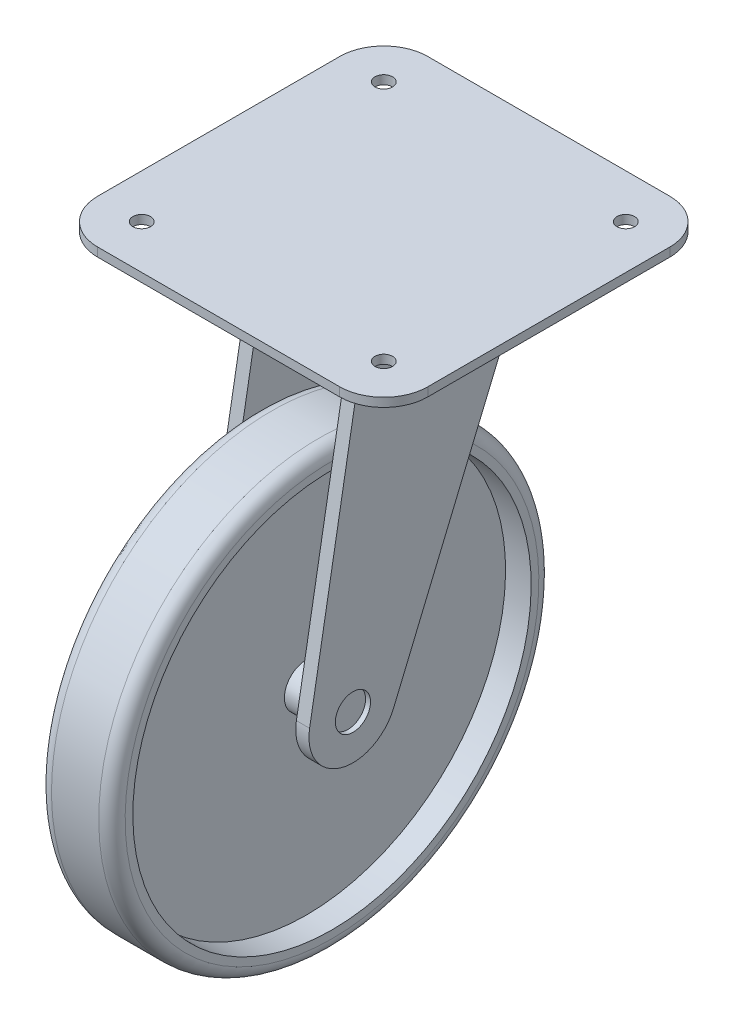
ISO-10303-21;
HEADER;
FILE_DESCRIPTION(('STEP AP214'),'2;1');
FILE_NAME('part.step','',(''),(''),'','','');
FILE_SCHEMA(('AUTOMOTIVE_DESIGN { 1 0 10303 214 1 1 1 1 }'));
ENDSEC;
DATA;
#1=APPLICATION_CONTEXT('core data for automotive mechanical design processes');
#2=APPLICATION_PROTOCOL_DEFINITION('international standard','automotive_design',2000,#1);
#3=PRODUCT_CONTEXT('',#1,'mechanical');
#4=PRODUCT('Part','Part','',(#3));
#5=PRODUCT_RELATED_PRODUCT_CATEGORY('part','',(#4));
#6=PRODUCT_DEFINITION_FORMATION('','',#4);
#7=PRODUCT_DEFINITION_CONTEXT('part definition',#1,'design');
#8=PRODUCT_DEFINITION('design','',#6,#7);
#9=PRODUCT_DEFINITION_SHAPE('','',#8);
#10=(LENGTH_UNIT() NAMED_UNIT(*) SI_UNIT(.MILLI.,.METRE.));
#11=(NAMED_UNIT(*) PLANE_ANGLE_UNIT() SI_UNIT($,.RADIAN.));
#12=(NAMED_UNIT(*) SI_UNIT($,.STERADIAN.) SOLID_ANGLE_UNIT());
#13=UNCERTAINTY_MEASURE_WITH_UNIT(LENGTH_MEASURE(1.E-05),#10,'distance_accuracy_value','');
#14=(GEOMETRIC_REPRESENTATION_CONTEXT(3) GLOBAL_UNCERTAINTY_ASSIGNED_CONTEXT((#13)) GLOBAL_UNIT_ASSIGNED_CONTEXT((#10,
#11,#12)) REPRESENTATION_CONTEXT('',''));
#15=CARTESIAN_POINT('',(0.,0.,0.));
#16=DIRECTION('',(0.,0.,1.));
#17=DIRECTION('',(1.,0.,0.));
#18=AXIS2_PLACEMENT_3D('',#15,#16,#17);
#19=CARTESIAN_POINT('',(11.8719218743825,-80.,20.));
#20=DIRECTION('',(-1.,0.,0.));
#21=DIRECTION('',(0.,-1.,0.));
#22=AXIS2_PLACEMENT_3D('',#19,#20,#21);
#23=PLANE('',#22);
#24=CARTESIAN_POINT('',(11.8719218743826,-80.,20.));
#25=DIRECTION('',(-1.,0.,0.));
#26=DIRECTION('',(0.,-1.,0.));
#27=AXIS2_PLACEMENT_3D('',#24,#25,#26);
#28=CIRCLE('',#27,5.);
#29=CARTESIAN_POINT('',(11.8719218743826,-85.,20.));
#30=VERTEX_POINT('',#29);
#31=EDGE_CURVE('E83',#30,#30,#28,.T.);
#32=ORIENTED_EDGE('',*,*,#31,.F.);
#33=EDGE_LOOP('',(#32));
#34=FACE_BOUND('',#33,.T.);
#35=ADVANCED_FACE('F43',(#34),#23,.F.);
#36=CARTESIAN_POINT('',(-12.1180558785947,-80.,20.));
#37=DIRECTION('',(1.,0.,0.));
#38=DIRECTION('',(0.,1.,0.));
#39=AXIS2_PLACEMENT_3D('',#36,#37,#38);
#40=PLANE('',#39);
#41=CARTESIAN_POINT('',(-12.1180558785947,-80.,20.));
#42=DIRECTION('',(-1.,0.,0.));
#43=DIRECTION('',(0.,-1.,0.));
#44=AXIS2_PLACEMENT_3D('',#41,#42,#43);
#45=CIRCLE('',#44,5.00000000000002);
#46=CARTESIAN_POINT('',(-12.1180558785947,-85.,20.));
#47=VERTEX_POINT('',#46);
#48=EDGE_CURVE('E11',#47,#47,#45,.T.);
#49=ORIENTED_EDGE('',*,*,#48,.T.);
#50=EDGE_LOOP('',(#49));
#51=FACE_BOUND('',#50,.T.);
#52=ADVANCED_FACE('F90',(#51),#40,.F.);
#53=CARTESIAN_POINT('',(-10.,-80.,20.));
#54=DIRECTION('',(-1.,0.,0.));
#55=DIRECTION('',(0.,-1.,0.));
#56=AXIS2_PLACEMENT_3D('',#53,#54,#55);
#57=CYLINDRICAL_SURFACE('',#56,5.00000000000002);
#58=ORIENTED_EDGE('',*,*,#48,.F.);
#59=EDGE_LOOP('',(#58));
#60=FACE_BOUND('',#59,.T.);
#61=CARTESIAN_POINT('',(-2.64928912323991,-80.,20.));
#62=DIRECTION('',(-1.,0.,0.));
#63=DIRECTION('',(0.,-1.,0.));
#64=AXIS2_PLACEMENT_3D('',#61,#62,#63);
#65=CIRCLE('',#64,5.00000000000001);
#66=CARTESIAN_POINT('',(-2.64928912323991,-85.,20.));
#67=VERTEX_POINT('',#66);
#68=EDGE_CURVE('E49',#67,#67,#65,.T.);
#69=ORIENTED_EDGE('',*,*,#68,.T.);
#70=EDGE_LOOP('',(#69));
#71=FACE_BOUND('',#70,.T.);
#72=ADVANCED_FACE('F94',(#60,#71),#57,.T.);
#73=CARTESIAN_POINT('',(-2.6492891232399,-75.,20.));
#74=DIRECTION('',(1.,0.,0.));
#75=DIRECTION('',(0.,1.,0.));
#76=AXIS2_PLACEMENT_3D('',#73,#74,#75);
#77=PLANE('',#76);
#78=ORIENTED_EDGE('',*,*,#68,.F.);
#79=EDGE_LOOP('',(#78));
#80=FACE_BOUND('',#79,.T.);
#81=CARTESIAN_POINT('',(-2.64928912323989,-80.,20.));
#82=DIRECTION('',(-1.,0.,0.));
#83=DIRECTION('',(0.,-1.,0.));
#84=AXIS2_PLACEMENT_3D('',#81,#82,#83);
#85=CIRCLE('',#84,45.251746634803);
#86=CARTESIAN_POINT('',(-2.64928912323986,-125.251746634803,20.));
#87=VERTEX_POINT('',#86);
#88=EDGE_CURVE('E53',#87,#87,#85,.T.);
#89=ORIENTED_EDGE('',*,*,#88,.T.);
#90=EDGE_LOOP('',(#89));
#91=FACE_BOUND('',#90,.T.);
#92=ADVANCED_FACE('F98',(#80,#91),#77,.F.);
#93=CARTESIAN_POINT('',(-10.,-80.,20.));
#94=DIRECTION('',(-1.,0.,0.));
#95=DIRECTION('',(0.,-1.,0.));
#96=AXIS2_PLACEMENT_3D('',#93,#94,#95);
#97=CYLINDRICAL_SURFACE('',#96,45.251746634803);
#98=ORIENTED_EDGE('',*,*,#88,.F.);
#99=EDGE_LOOP('',(#98));
#100=FACE_BOUND('',#99,.T.);
#101=CARTESIAN_POINT('',(-8.49771205244607,-80.,20.));
#102=DIRECTION('',(-1.,0.,0.));
#103=DIRECTION('',(0.,-1.,0.));
#104=AXIS2_PLACEMENT_3D('',#101,#102,#103);
#105=CIRCLE('',#104,45.251746634803);
#106=CARTESIAN_POINT('',(-8.49771205244604,-125.251746634803,20.));
#107=VERTEX_POINT('',#106);
#108=EDGE_CURVE('E57',#107,#107,#105,.T.);
#109=ORIENTED_EDGE('',*,*,#108,.T.);
#110=EDGE_LOOP('',(#109));
#111=FACE_BOUND('',#110,.T.);
#112=ADVANCED_FACE('F104',(#100,#111),#97,.F.);
#113=CARTESIAN_POINT('',(-8.49771205244609,-33.,20.));
#114=DIRECTION('',(1.,0.,0.));
#115=DIRECTION('',(0.,1.,0.));
#116=AXIS2_PLACEMENT_3D('',#113,#114,#115);
#117=PLANE('',#116);
#118=ORIENTED_EDGE('',*,*,#108,.F.);
#119=EDGE_LOOP('',(#118));
#120=FACE_BOUND('',#119,.T.);
#121=CARTESIAN_POINT('',(-8.49771205244606,-80.,20.));
#122=DIRECTION('',(-1.,0.,0.));
#123=DIRECTION('',(0.,-1.,0.));
#124=AXIS2_PLACEMENT_3D('',#121,#122,#123);
#125=CIRCLE('',#124,47.);
#126=CARTESIAN_POINT('',(-8.49771205244604,-127.,20.));
#127=VERTEX_POINT('',#126);
#128=EDGE_CURVE('E62',#127,#127,#125,.T.);
#129=ORIENTED_EDGE('',*,*,#128,.T.);
#130=EDGE_LOOP('',(#129));
#131=FACE_BOUND('',#130,.T.);
#132=ADVANCED_FACE('F108',(#120,#131),#117,.F.);
#133=CARTESIAN_POINT('',(-5.49771205244606,-80.,20.));
#134=DIRECTION('',(-1.,0.,0.));
#135=DIRECTION('',(0.,-1.,0.));
#136=AXIS2_PLACEMENT_3D('',#133,#134,#135);
#137=TOROIDAL_SURFACE('',#136,47.,3.);
#138=ORIENTED_EDGE('',*,*,#128,.F.);
#139=EDGE_LOOP('',(#138));
#140=FACE_BOUND('',#139,.T.);
#141=CARTESIAN_POINT('',(-5.49771205244606,-80.,20.));
#142=DIRECTION('',(-1.,0.,0.));
#143=DIRECTION('',(0.,-1.,0.));
#144=AXIS2_PLACEMENT_3D('',#141,#142,#143);
#145=CIRCLE('',#144,50.);
#146=CARTESIAN_POINT('',(-5.49771205244603,-130.,20.));
#147=VERTEX_POINT('',#146);
#148=EDGE_CURVE('E65',#147,#147,#145,.T.);
#149=ORIENTED_EDGE('',*,*,#148,.T.);
#150=EDGE_LOOP('',(#149));
#151=FACE_BOUND('',#150,.T.);
#152=ADVANCED_FACE('F112',(#140,#151),#137,.T.);
#153=CARTESIAN_POINT('',(-10.,-80.,20.));
#154=DIRECTION('',(-1.,0.,0.));
#155=DIRECTION('',(0.,-1.,0.));
#156=AXIS2_PLACEMENT_3D('',#153,#154,#155);
#157=CYLINDRICAL_SURFACE('',#156,50.);
#158=ORIENTED_EDGE('',*,*,#148,.F.);
#159=EDGE_LOOP('',(#158));
#160=FACE_BOUND('',#159,.T.);
#161=CARTESIAN_POINT('',(5.24062529719608,-80.,20.));
#162=DIRECTION('',(-1.,0.,0.));
#163=DIRECTION('',(0.,-1.,0.));
#164=AXIS2_PLACEMENT_3D('',#161,#162,#163);
#165=CIRCLE('',#164,50.);
#166=CARTESIAN_POINT('',(5.24062529719611,-130.,20.));
#167=VERTEX_POINT('',#166);
#168=EDGE_CURVE('E68',#167,#167,#165,.T.);
#169=ORIENTED_EDGE('',*,*,#168,.T.);
#170=EDGE_LOOP('',(#169));
#171=FACE_BOUND('',#170,.T.);
#172=ADVANCED_FACE('F116',(#160,#171),#157,.T.);
#173=CARTESIAN_POINT('',(5.24062529719608,-80.,20.));
#174=DIRECTION('',(-1.,0.,0.));
#175=DIRECTION('',(0.,-1.,0.));
#176=AXIS2_PLACEMENT_3D('',#173,#174,#175);
#177=TOROIDAL_SURFACE('',#176,47.,3.);
#178=ORIENTED_EDGE('',*,*,#168,.F.);
#179=EDGE_LOOP('',(#178));
#180=FACE_BOUND('',#179,.T.);
#181=CARTESIAN_POINT('',(8.24062529719608,-80.,20.));
#182=DIRECTION('',(-1.,0.,0.));
#183=DIRECTION('',(0.,-1.,0.));
#184=AXIS2_PLACEMENT_3D('',#181,#182,#183);
#185=CIRCLE('',#184,47.);
#186=CARTESIAN_POINT('',(8.24062529719611,-127.,20.));
#187=VERTEX_POINT('',#186);
#188=EDGE_CURVE('E71',#187,#187,#185,.T.);
#189=ORIENTED_EDGE('',*,*,#188,.T.);
#190=EDGE_LOOP('',(#189));
#191=FACE_BOUND('',#190,.T.);
#192=ADVANCED_FACE('F120',(#180,#191),#177,.T.);
#193=CARTESIAN_POINT('',(8.24062529719605,-33.,20.));
#194=DIRECTION('',(-1.,0.,0.));
#195=DIRECTION('',(0.,-1.,0.));
#196=AXIS2_PLACEMENT_3D('',#193,#194,#195);
#197=PLANE('',#196);
#198=ORIENTED_EDGE('',*,*,#188,.F.);
#199=EDGE_LOOP('',(#198));
#200=FACE_BOUND('',#199,.T.);
#201=CARTESIAN_POINT('',(8.24062529719608,-80.,20.));
#202=DIRECTION('',(-1.,0.,0.));
#203=DIRECTION('',(0.,-1.,0.));
#204=AXIS2_PLACEMENT_3D('',#201,#202,#203);
#205=CIRCLE('',#204,45.251746634803);
#206=CARTESIAN_POINT('',(8.24062529719611,-125.251746634803,20.));
#207=VERTEX_POINT('',#206);
#208=EDGE_CURVE('E74',#207,#207,#205,.T.);
#209=ORIENTED_EDGE('',*,*,#208,.T.);
#210=EDGE_LOOP('',(#209));
#211=FACE_BOUND('',#210,.T.);
#212=ADVANCED_FACE('F124',(#200,#211),#197,.F.);
#213=CARTESIAN_POINT('',(-10.,-80.,20.));
#214=DIRECTION('',(-1.,0.,0.));
#215=DIRECTION('',(0.,-1.,0.));
#216=AXIS2_PLACEMENT_3D('',#213,#214,#215);
#217=CYLINDRICAL_SURFACE('',#216,45.251746634803);
#218=ORIENTED_EDGE('',*,*,#208,.F.);
#219=EDGE_LOOP('',(#218));
#220=FACE_BOUND('',#219,.T.);
#221=CARTESIAN_POINT('',(2.42722895289974,-80.,20.));
#222=DIRECTION('',(-1.,0.,0.));
#223=DIRECTION('',(0.,-1.,0.));
#224=AXIS2_PLACEMENT_3D('',#221,#222,#223);
#225=CIRCLE('',#224,45.251746634803);
#226=CARTESIAN_POINT('',(2.42722895289977,-125.251746634803,20.));
#227=VERTEX_POINT('',#226);
#228=EDGE_CURVE('E77',#227,#227,#225,.T.);
#229=ORIENTED_EDGE('',*,*,#228,.T.);
#230=EDGE_LOOP('',(#229));
#231=FACE_BOUND('',#230,.T.);
#232=ADVANCED_FACE('F128',(#220,#231),#217,.F.);
#233=CARTESIAN_POINT('',(2.42722895289972,-75.,20.));
#234=DIRECTION('',(-1.,0.,0.));
#235=DIRECTION('',(0.,-1.,0.));
#236=AXIS2_PLACEMENT_3D('',#233,#234,#235);
#237=PLANE('',#236);
#238=ORIENTED_EDGE('',*,*,#228,.F.);
#239=EDGE_LOOP('',(#238));
#240=FACE_BOUND('',#239,.T.);
#241=CARTESIAN_POINT('',(2.42722895289971,-80.,20.));
#242=DIRECTION('',(-1.,0.,0.));
#243=DIRECTION('',(0.,-1.,0.));
#244=AXIS2_PLACEMENT_3D('',#241,#242,#243);
#245=CIRCLE('',#244,5.00000000000001);
#246=CARTESIAN_POINT('',(2.42722895289971,-85.,20.));
#247=VERTEX_POINT('',#246);
#248=EDGE_CURVE('E80',#247,#247,#245,.T.);
#249=ORIENTED_EDGE('',*,*,#248,.T.);
#250=EDGE_LOOP('',(#249));
#251=FACE_BOUND('',#250,.T.);
#252=ADVANCED_FACE('F132',(#240,#251),#237,.F.);
#253=CARTESIAN_POINT('',(-10.,-80.,20.));
#254=DIRECTION('',(-1.,0.,0.));
#255=DIRECTION('',(0.,-1.,0.));
#256=AXIS2_PLACEMENT_3D('',#253,#254,#255);
#257=CYLINDRICAL_SURFACE('',#256,5.);
#258=ORIENTED_EDGE('',*,*,#248,.F.);
#259=EDGE_LOOP('',(#258));
#260=FACE_BOUND('',#259,.T.);
#261=ORIENTED_EDGE('',*,*,#31,.T.);
#262=EDGE_LOOP('',(#261));
#263=FACE_BOUND('',#262,.T.);
#264=ADVANCED_FACE('F87',(#260,#263),#257,.T.);
#265=CLOSED_SHELL('',(#35,#52,#72,#92,#112,#132,#152,#172,#192,#212,#232,#252,#264));
#266=MANIFOLD_SOLID_BREP('B2',#265);
#267=CARTESIAN_POINT('',(0.,-8.,0.));
#268=DIRECTION('',(0.,-1.,0.));
#269=DIRECTION('',(0.,0.,-1.));
#270=AXIS2_PLACEMENT_3D('',#267,#268,#269);
#271=PLANE('',#270);
#272=DIRECTION('',(1.,0.,0.));
#273=VECTOR('',#272,1.);
#274=CARTESIAN_POINT('',(-13.,-8.,17.549509852951));
#275=LINE('',#274,#273);
#276=CARTESIAN_POINT('',(-13.,-8.,17.549509852951));
#277=VERTEX_POINT('',#276);
#278=CARTESIAN_POINT('',(-11.9970217222776,-8.,17.549509852951));
#279=VERTEX_POINT('',#278);
#280=EDGE_CURVE('E377',#277,#279,#275,.T.);
#281=ORIENTED_EDGE('',*,*,#280,.T.);
#282=CARTESIAN_POINT('',(0.,-8.,0.));
#283=DIRECTION('',(0.,-1.,0.));
#284=DIRECTION('',(0.,0.,-1.));
#285=AXIS2_PLACEMENT_3D('',#282,#283,#284);
#286=CIRCLE('',#285,21.2582648935331);
#287=CARTESIAN_POINT('',(11.9970217222776,-8.,17.549509852951));
#288=VERTEX_POINT('',#287);
#289=EDGE_CURVE('E843',#288,#279,#286,.T.);
#290=ORIENTED_EDGE('',*,*,#289,.F.);
#291=DIRECTION('',(-1.,0.,0.));
#292=VECTOR('',#291,1.);
#293=CARTESIAN_POINT('',(13.,-8.,17.549509852951));
#294=LINE('',#293,#292);
#295=CARTESIAN_POINT('',(13.,-8.,17.549509852951));
#296=VERTEX_POINT('',#295);
#297=EDGE_CURVE('E454',#296,#288,#294,.T.);
#298=ORIENTED_EDGE('',*,*,#297,.F.);
#299=DIRECTION('',(0.,0.,1.));
#300=VECTOR('',#299,1.);
#301=CARTESIAN_POINT('',(13.,-8.,17.549509852951));
#302=LINE('',#301,#300);
#303=CARTESIAN_POINT('',(13.,-8.,16.8200423983896));
#304=VERTEX_POINT('',#303);
#305=EDGE_CURVE('E41',#304,#296,#302,.T.);
#306=ORIENTED_EDGE('',*,*,#305,.F.);
#307=CARTESIAN_POINT('',(13.,-8.,-16.8200423983896));
#308=VERTEX_POINT('',#307);
#309=EDGE_CURVE('E471',#308,#304,#286,.T.);
#310=ORIENTED_EDGE('',*,*,#309,.F.);
#311=CARTESIAN_POINT('',(13.,-8.,-20.963551469519));
#312=VERTEX_POINT('',#311);
#313=EDGE_CURVE('E244',#312,#308,#302,.T.);
#314=ORIENTED_EDGE('',*,*,#313,.F.);
#315=DIRECTION('',(-1.,0.,0.));
#316=VECTOR('',#315,1.);
#317=CARTESIAN_POINT('',(13.,-8.,-20.963551469519));
#318=LINE('',#317,#316);
#319=CARTESIAN_POINT('',(10.,-8.,-20.963551469519));
#320=VERTEX_POINT('',#319);
#321=EDGE_CURVE('E457',#312,#320,#318,.T.);
#322=ORIENTED_EDGE('',*,*,#321,.T.);
#323=DIRECTION('',(0.,0.,1.));
#324=VECTOR('',#323,1.);
#325=CARTESIAN_POINT('',(10.,-8.,17.549509852951));
#326=LINE('',#325,#324);
#327=CARTESIAN_POINT('',(10.,-8.,-18.7593663614639));
#328=VERTEX_POINT('',#327);
#329=EDGE_CURVE('E438',#320,#328,#326,.T.);
#330=ORIENTED_EDGE('',*,*,#329,.T.);
#331=CARTESIAN_POINT('',(-10.,-8.,-18.7593663614639));
#332=VERTEX_POINT('',#331);
#333=EDGE_CURVE('E472',#332,#328,#286,.T.);
#334=ORIENTED_EDGE('',*,*,#333,.F.);
#335=DIRECTION('',(0.,0.,1.));
#336=VECTOR('',#335,1.);
#337=CARTESIAN_POINT('',(-10.,-8.,17.549509852951));
#338=LINE('',#337,#336);
#339=CARTESIAN_POINT('',(-10.,-8.,-20.963551469519));
#340=VERTEX_POINT('',#339);
#341=EDGE_CURVE('E252',#340,#332,#338,.T.);
#342=ORIENTED_EDGE('',*,*,#341,.F.);
#343=DIRECTION('',(1.,0.,0.));
#344=VECTOR('',#343,1.);
#345=CARTESIAN_POINT('',(-13.,-8.,-20.963551469519));
#346=LINE('',#345,#344);
#347=CARTESIAN_POINT('',(-13.,-8.,-20.963551469519));
#348=VERTEX_POINT('',#347);
#349=EDGE_CURVE('E426',#348,#340,#346,.T.);
#350=ORIENTED_EDGE('',*,*,#349,.F.);
#351=DIRECTION('',(0.,0.,1.));
#352=VECTOR('',#351,1.);
#353=CARTESIAN_POINT('',(-13.,-8.,17.549509852951));
#354=LINE('',#353,#352);
#355=CARTESIAN_POINT('',(-13.,-8.,-16.8200423983896));
#356=VERTEX_POINT('',#355);
#357=EDGE_CURVE('E404',#348,#356,#354,.T.);
#358=ORIENTED_EDGE('',*,*,#357,.T.);
#359=CARTESIAN_POINT('',(-13.,-8.,16.8200423983896));
#360=VERTEX_POINT('',#359);
#361=EDGE_CURVE('E401',#360,#356,#286,.T.);
#362=ORIENTED_EDGE('',*,*,#361,.F.);
#363=EDGE_CURVE('E391',#360,#277,#354,.T.);
#364=ORIENTED_EDGE('',*,*,#363,.T.);
#365=EDGE_LOOP('',(#281,#290,#298,#306,#310,#314,#322,#330,#334,#342,#350,#358,#362,#364));
#366=FACE_BOUND('',#365,.T.);
#367=CARTESIAN_POINT('',(0.,-8.,0.));
#368=DIRECTION('',(0.,-1.,0.));
#369=DIRECTION('',(0.,0.,-1.));
#370=AXIS2_PLACEMENT_3D('',#367,#368,#369);
#371=CIRCLE('',#370,25.);
#372=CARTESIAN_POINT('',(0.,-8.,-25.));
#373=VERTEX_POINT('',#372);
#374=EDGE_CURVE('E470',#373,#373,#371,.T.);
#375=ORIENTED_EDGE('',*,*,#374,.T.);
#376=EDGE_LOOP('',(#375));
#377=FACE_BOUND('',#376,.T.);
#378=ADVANCED_FACE('F234',(#366,#377),#271,.T.);
#379=CARTESIAN_POINT('',(-37.5,-2.,37.5));
#380=DIRECTION('',(0.,1.,0.));
#381=DIRECTION('',(0.,0.,1.));
#382=AXIS2_PLACEMENT_3D('',#379,#380,#381);
#383=PLANE('',#382);
#384=CARTESIAN_POINT('',(-27.5,-2.,-27.5));
#385=DIRECTION('',(0.,1.,0.));
#386=DIRECTION('',(0.,0.,1.));
#387=AXIS2_PLACEMENT_3D('',#384,#385,#386);
#388=CIRCLE('',#387,2.);
#389=CARTESIAN_POINT('',(-27.5,-2.,-25.5));
#390=VERTEX_POINT('',#389);
#391=EDGE_CURVE('E478',#390,#390,#388,.T.);
#392=ORIENTED_EDGE('',*,*,#391,.T.);
#393=EDGE_LOOP('',(#392));
#394=FACE_BOUND('',#393,.T.);
#395=CARTESIAN_POINT('',(-27.5,-2.,27.5));
#396=DIRECTION('',(0.,1.,0.));
#397=DIRECTION('',(0.,0.,1.));
#398=AXIS2_PLACEMENT_3D('',#395,#396,#397);
#399=CIRCLE('',#398,2.);
#400=CARTESIAN_POINT('',(-27.5,-2.,29.5));
#401=VERTEX_POINT('',#400);
#402=EDGE_CURVE('E484',#401,#401,#399,.T.);
#403=ORIENTED_EDGE('',*,*,#402,.T.);
#404=EDGE_LOOP('',(#403));
#405=FACE_BOUND('',#404,.T.);
#406=CARTESIAN_POINT('',(27.5,-2.,27.5));
#407=DIRECTION('',(0.,1.,0.));
#408=DIRECTION('',(0.,0.,1.));
#409=AXIS2_PLACEMENT_3D('',#406,#407,#408);
#410=CIRCLE('',#409,2.);
#411=CARTESIAN_POINT('',(27.5,-2.,29.5));
#412=VERTEX_POINT('',#411);
#413=EDGE_CURVE('E490',#412,#412,#410,.T.);
#414=ORIENTED_EDGE('',*,*,#413,.T.);
#415=EDGE_LOOP('',(#414));
#416=FACE_BOUND('',#415,.T.);
#417=CARTESIAN_POINT('',(27.5,-2.,-27.5));
#418=DIRECTION('',(0.,1.,0.));
#419=DIRECTION('',(0.,0.,1.));
#420=AXIS2_PLACEMENT_3D('',#417,#418,#419);
#421=CIRCLE('',#420,2.);
#422=CARTESIAN_POINT('',(27.5,-2.,-25.5));
#423=VERTEX_POINT('',#422);
#424=EDGE_CURVE('E496',#423,#423,#421,.T.);
#425=ORIENTED_EDGE('',*,*,#424,.T.);
#426=EDGE_LOOP('',(#425));
#427=FACE_BOUND('',#426,.T.);
#428=DIRECTION('',(1.,0.,0.));
#429=VECTOR('',#428,1.);
#430=CARTESIAN_POINT('',(-37.5,-2.,37.5));
#431=LINE('',#430,#429);
#432=CARTESIAN_POINT('',(-27.5,-2.,37.5));
#433=VERTEX_POINT('',#432);
#434=CARTESIAN_POINT('',(27.5,-2.,37.5));
#435=VERTEX_POINT('',#434);
#436=EDGE_CURVE('E505',#433,#435,#431,.T.);
#437=ORIENTED_EDGE('',*,*,#436,.F.);
#438=CARTESIAN_POINT('',(-27.5,-2.,27.5));
#439=DIRECTION('',(0.,1.,0.));
#440=DIRECTION('',(0.,0.,1.));
#441=AXIS2_PLACEMENT_3D('',#438,#439,#440);
#442=CIRCLE('',#441,10.);
#443=CARTESIAN_POINT('',(-37.5,-2.,27.5));
#444=VERTEX_POINT('',#443);
#445=EDGE_CURVE('E549',#433,#444,#442,.F.);
#446=ORIENTED_EDGE('',*,*,#445,.T.);
#447=DIRECTION('',(0.,0.,1.));
#448=VECTOR('',#447,1.);
#449=CARTESIAN_POINT('',(-37.5,-2.,-37.5));
#450=LINE('',#449,#448);
#451=CARTESIAN_POINT('',(-37.5,-2.,-27.5));
#452=VERTEX_POINT('',#451);
#453=EDGE_CURVE('E502',#452,#444,#450,.T.);
#454=ORIENTED_EDGE('',*,*,#453,.F.);
#455=CARTESIAN_POINT('',(-27.5,-2.,-27.5));
#456=DIRECTION('',(0.,1.,0.));
#457=DIRECTION('',(0.,0.,1.));
#458=AXIS2_PLACEMENT_3D('',#455,#456,#457);
#459=CIRCLE('',#458,10.);
#460=CARTESIAN_POINT('',(-27.5,-2.,-37.5));
#461=VERTEX_POINT('',#460);
#462=EDGE_CURVE('E547',#452,#461,#459,.F.);
#463=ORIENTED_EDGE('',*,*,#462,.T.);
#464=DIRECTION('',(-1.,0.,0.));
#465=VECTOR('',#464,1.);
#466=CARTESIAN_POINT('',(-37.5,-2.,-37.5));
#467=LINE('',#466,#465);
#468=CARTESIAN_POINT('',(27.5,-2.,-37.5));
#469=VERTEX_POINT('',#468);
#470=EDGE_CURVE('E512',#469,#461,#467,.T.);
#471=ORIENTED_EDGE('',*,*,#470,.F.);
#472=CARTESIAN_POINT('',(27.5,-2.,-27.5));
#473=DIRECTION('',(0.,1.,0.));
#474=DIRECTION('',(0.,0.,1.));
#475=AXIS2_PLACEMENT_3D('',#472,#473,#474);
#476=CIRCLE('',#475,10.);
#477=CARTESIAN_POINT('',(37.5,-2.,-27.5));
#478=VERTEX_POINT('',#477);
#479=EDGE_CURVE('E545',#469,#478,#476,.F.);
#480=ORIENTED_EDGE('',*,*,#479,.T.);
#481=DIRECTION('',(0.,0.,-1.));
#482=VECTOR('',#481,1.);
#483=CARTESIAN_POINT('',(37.5,-2.,-37.5));
#484=LINE('',#483,#482);
#485=CARTESIAN_POINT('',(37.5,-2.,27.5));
#486=VERTEX_POINT('',#485);
#487=EDGE_CURVE('E509',#486,#478,#484,.T.);
#488=ORIENTED_EDGE('',*,*,#487,.F.);
#489=CARTESIAN_POINT('',(27.5,-2.,27.5));
#490=DIRECTION('',(0.,1.,0.));
#491=DIRECTION('',(0.,0.,1.));
#492=AXIS2_PLACEMENT_3D('',#489,#490,#491);
#493=CIRCLE('',#492,10.);
#494=EDGE_CURVE('E543',#486,#435,#493,.F.);
#495=ORIENTED_EDGE('',*,*,#494,.T.);
#496=EDGE_LOOP('',(#437,#446,#454,#463,#471,#480,#488,#495));
#497=FACE_BOUND('',#496,.T.);
#498=CARTESIAN_POINT('',(0.,-2.,0.));
#499=DIRECTION('',(0.,1.,0.));
#500=DIRECTION('',(0.,0.,1.));
#501=AXIS2_PLACEMENT_3D('',#498,#499,#500);
#502=CIRCLE('',#501,25.);
#503=CARTESIAN_POINT('',(0.,-2.,25.));
#504=VERTEX_POINT('',#503);
#505=EDGE_CURVE('E238',#504,#504,#502,.F.);
#506=ORIENTED_EDGE('',*,*,#505,.F.);
#507=EDGE_LOOP('',(#506));
#508=FACE_BOUND('',#507,.T.);
#509=ADVANCED_FACE('F567',(#394,#405,#416,#427,#497,#508),#383,.F.);
#510=CARTESIAN_POINT('',(-37.5,-2.,-37.5));
#511=DIRECTION('',(-1.,0.,0.));
#512=DIRECTION('',(0.,0.,1.));
#513=AXIS2_PLACEMENT_3D('',#510,#511,#512);
#514=PLANE('',#513);
#515=ORIENTED_EDGE('',*,*,#453,.T.);
#516=DIRECTION('',(0.,1.,0.));
#517=VECTOR('',#516,1.);
#518=CARTESIAN_POINT('',(-37.5,-2.,27.5));
#519=LINE('',#518,#517);
#520=CARTESIAN_POINT('',(-37.5,0.,27.5));
#521=VERTEX_POINT('',#520);
#522=EDGE_CURVE('E527',#444,#521,#519,.T.);
#523=ORIENTED_EDGE('',*,*,#522,.T.);
#524=DIRECTION('',(0.,0.,1.));
#525=VECTOR('',#524,1.);
#526=CARTESIAN_POINT('',(-37.5,0.,-37.5));
#527=LINE('',#526,#525);
#528=CARTESIAN_POINT('',(-37.5,0.,-27.5));
#529=VERTEX_POINT('',#528);
#530=EDGE_CURVE('E499',#529,#521,#527,.T.);
#531=ORIENTED_EDGE('',*,*,#530,.F.);
#532=DIRECTION('',(0.,1.,0.));
#533=VECTOR('',#532,1.);
#534=CARTESIAN_POINT('',(-37.5,-2.,-27.5));
#535=LINE('',#534,#533);
#536=EDGE_CURVE('E515',#529,#452,#535,.F.);
#537=ORIENTED_EDGE('',*,*,#536,.T.);
#538=EDGE_LOOP('',(#515,#523,#531,#537));
#539=FACE_BOUND('',#538,.T.);
#540=ADVANCED_FACE('F569',(#539),#514,.T.);
#541=CARTESIAN_POINT('',(-37.5,-2.,-37.5));
#542=DIRECTION('',(0.,0.,-1.));
#543=DIRECTION('',(-1.,0.,0.));
#544=AXIS2_PLACEMENT_3D('',#541,#542,#543);
#545=PLANE('',#544);
#546=ORIENTED_EDGE('',*,*,#470,.T.);
#547=DIRECTION('',(0.,1.,0.));
#548=VECTOR('',#547,1.);
#549=CARTESIAN_POINT('',(-27.5,-2.,-37.5));
#550=LINE('',#549,#548);
#551=CARTESIAN_POINT('',(-27.5,0.,-37.5));
#552=VERTEX_POINT('',#551);
#553=EDGE_CURVE('E553',#461,#552,#550,.T.);
#554=ORIENTED_EDGE('',*,*,#553,.T.);
#555=DIRECTION('',(-1.,0.,0.));
#556=VECTOR('',#555,1.);
#557=CARTESIAN_POINT('',(-37.5,0.,-37.5));
#558=LINE('',#557,#556);
#559=CARTESIAN_POINT('',(27.5,0.,-37.5));
#560=VERTEX_POINT('',#559);
#561=EDGE_CURVE('E506',#560,#552,#558,.T.);
#562=ORIENTED_EDGE('',*,*,#561,.F.);
#563=DIRECTION('',(0.,1.,0.));
#564=VECTOR('',#563,1.);
#565=CARTESIAN_POINT('',(27.5,-2.,-37.5));
#566=LINE('',#565,#564);
#567=EDGE_CURVE('E551',#560,#469,#566,.F.);
#568=ORIENTED_EDGE('',*,*,#567,.T.);
#569=EDGE_LOOP('',(#546,#554,#562,#568));
#570=FACE_BOUND('',#569,.T.);
#571=ADVANCED_FACE('F577',(#570),#545,.T.);
#572=CARTESIAN_POINT('',(37.5,-2.,-37.5));
#573=DIRECTION('',(1.,0.,0.));
#574=DIRECTION('',(0.,0.,-1.));
#575=AXIS2_PLACEMENT_3D('',#572,#573,#574);
#576=PLANE('',#575);
#577=ORIENTED_EDGE('',*,*,#487,.T.);
#578=DIRECTION('',(0.,1.,0.));
#579=VECTOR('',#578,1.);
#580=CARTESIAN_POINT('',(37.5,-2.,-27.5));
#581=LINE('',#580,#579);
#582=CARTESIAN_POINT('',(37.5,0.,-27.5));
#583=VERTEX_POINT('',#582);
#584=EDGE_CURVE('E557',#478,#583,#581,.T.);
#585=ORIENTED_EDGE('',*,*,#584,.T.);
#586=DIRECTION('',(0.,0.,-1.));
#587=VECTOR('',#586,1.);
#588=CARTESIAN_POINT('',(37.5,0.,-37.5));
#589=LINE('',#588,#587);
#590=CARTESIAN_POINT('',(37.5,0.,27.5));
#591=VERTEX_POINT('',#590);
#592=EDGE_CURVE('E521',#591,#583,#589,.T.);
#593=ORIENTED_EDGE('',*,*,#592,.F.);
#594=DIRECTION('',(0.,1.,0.));
#595=VECTOR('',#594,1.);
#596=CARTESIAN_POINT('',(37.5,-2.,27.5));
#597=LINE('',#596,#595);
#598=EDGE_CURVE('E556',#591,#486,#597,.F.);
#599=ORIENTED_EDGE('',*,*,#598,.T.);
#600=EDGE_LOOP('',(#577,#585,#593,#599));
#601=FACE_BOUND('',#600,.T.);
#602=ADVANCED_FACE('F654',(#601),#576,.T.);
#603=CARTESIAN_POINT('',(-37.5,-2.,37.5));
#604=DIRECTION('',(0.,0.,1.));
#605=DIRECTION('',(1.,0.,0.));
#606=AXIS2_PLACEMENT_3D('',#603,#604,#605);
#607=PLANE('',#606);
#608=DIRECTION('',(1.,0.,0.));
#609=VECTOR('',#608,1.);
#610=CARTESIAN_POINT('',(-37.5,0.,37.5));
#611=LINE('',#610,#609);
#612=CARTESIAN_POINT('',(-27.5,0.,37.5));
#613=VERTEX_POINT('',#612);
#614=CARTESIAN_POINT('',(27.5,0.,37.5));
#615=VERTEX_POINT('',#614);
#616=EDGE_CURVE('E518',#613,#615,#611,.T.);
#617=ORIENTED_EDGE('',*,*,#616,.F.);
#618=DIRECTION('',(0.,1.,0.));
#619=VECTOR('',#618,1.);
#620=CARTESIAN_POINT('',(-27.5,-2.,37.5));
#621=LINE('',#620,#619);
#622=EDGE_CURVE('E541',#613,#433,#621,.F.);
#623=ORIENTED_EDGE('',*,*,#622,.T.);
#624=ORIENTED_EDGE('',*,*,#436,.T.);
#625=DIRECTION('',(0.,1.,0.));
#626=VECTOR('',#625,1.);
#627=CARTESIAN_POINT('',(27.5,-2.,37.5));
#628=LINE('',#627,#626);
#629=EDGE_CURVE('E538',#435,#615,#628,.T.);
#630=ORIENTED_EDGE('',*,*,#629,.T.);
#631=EDGE_LOOP('',(#617,#623,#624,#630));
#632=FACE_BOUND('',#631,.T.);
#633=ADVANCED_FACE('F627',(#632),#607,.T.);
#634=CARTESIAN_POINT('',(-37.5,0.,37.5));
#635=DIRECTION('',(0.,1.,0.));
#636=DIRECTION('',(0.,0.,1.));
#637=AXIS2_PLACEMENT_3D('',#634,#635,#636);
#638=PLANE('',#637);
#639=CARTESIAN_POINT('',(-27.5,0.,-27.5));
#640=DIRECTION('',(0.,1.,0.));
#641=DIRECTION('',(0.,0.,1.));
#642=AXIS2_PLACEMENT_3D('',#639,#640,#641);
#643=CIRCLE('',#642,2.);
#644=CARTESIAN_POINT('',(-27.5,0.,-25.5));
#645=VERTEX_POINT('',#644);
#646=EDGE_CURVE('E477',#645,#645,#643,.T.);
#647=ORIENTED_EDGE('',*,*,#646,.F.);
#648=EDGE_LOOP('',(#647));
#649=FACE_BOUND('',#648,.T.);
#650=CARTESIAN_POINT('',(-27.5,0.,27.5));
#651=DIRECTION('',(0.,1.,0.));
#652=DIRECTION('',(0.,0.,1.));
#653=AXIS2_PLACEMENT_3D('',#650,#651,#652);
#654=CIRCLE('',#653,2.);
#655=CARTESIAN_POINT('',(-27.5,0.,29.5));
#656=VERTEX_POINT('',#655);
#657=EDGE_CURVE('E481',#656,#656,#654,.T.);
#658=ORIENTED_EDGE('',*,*,#657,.F.);
#659=EDGE_LOOP('',(#658));
#660=FACE_BOUND('',#659,.T.);
#661=CARTESIAN_POINT('',(27.5,0.,27.5));
#662=DIRECTION('',(0.,1.,0.));
#663=DIRECTION('',(0.,0.,1.));
#664=AXIS2_PLACEMENT_3D('',#661,#662,#663);
#665=CIRCLE('',#664,2.);
#666=CARTESIAN_POINT('',(27.5,0.,29.5));
#667=VERTEX_POINT('',#666);
#668=EDGE_CURVE('E487',#667,#667,#665,.T.);
#669=ORIENTED_EDGE('',*,*,#668,.F.);
#670=EDGE_LOOP('',(#669));
#671=FACE_BOUND('',#670,.T.);
#672=CARTESIAN_POINT('',(27.5,0.,-27.5));
#673=DIRECTION('',(0.,1.,0.));
#674=DIRECTION('',(0.,0.,1.));
#675=AXIS2_PLACEMENT_3D('',#672,#673,#674);
#676=CIRCLE('',#675,2.);
#677=CARTESIAN_POINT('',(27.5,0.,-25.5));
#678=VERTEX_POINT('',#677);
#679=EDGE_CURVE('E493',#678,#678,#676,.T.);
#680=ORIENTED_EDGE('',*,*,#679,.F.);
#681=EDGE_LOOP('',(#680));
#682=FACE_BOUND('',#681,.T.);
#683=ORIENTED_EDGE('',*,*,#530,.T.);
#684=CARTESIAN_POINT('',(-27.5,0.,27.5));
#685=DIRECTION('',(0.,1.,0.));
#686=DIRECTION('',(0.,0.,1.));
#687=AXIS2_PLACEMENT_3D('',#684,#685,#686);
#688=CIRCLE('',#687,10.);
#689=EDGE_CURVE('E536',#521,#613,#688,.T.);
#690=ORIENTED_EDGE('',*,*,#689,.T.);
#691=ORIENTED_EDGE('',*,*,#616,.T.);
#692=CARTESIAN_POINT('',(27.5,0.,27.5));
#693=DIRECTION('',(0.,1.,0.));
#694=DIRECTION('',(0.,0.,1.));
#695=AXIS2_PLACEMENT_3D('',#692,#693,#694);
#696=CIRCLE('',#695,10.);
#697=EDGE_CURVE('E530',#615,#591,#696,.T.);
#698=ORIENTED_EDGE('',*,*,#697,.T.);
#699=ORIENTED_EDGE('',*,*,#592,.T.);
#700=CARTESIAN_POINT('',(27.5,0.,-27.5));
#701=DIRECTION('',(0.,1.,0.));
#702=DIRECTION('',(0.,0.,1.));
#703=AXIS2_PLACEMENT_3D('',#700,#701,#702);
#704=CIRCLE('',#703,10.);
#705=EDGE_CURVE('E532',#583,#560,#704,.T.);
#706=ORIENTED_EDGE('',*,*,#705,.T.);
#707=ORIENTED_EDGE('',*,*,#561,.T.);
#708=CARTESIAN_POINT('',(-27.5,0.,-27.5));
#709=DIRECTION('',(0.,1.,0.));
#710=DIRECTION('',(0.,0.,1.));
#711=AXIS2_PLACEMENT_3D('',#708,#709,#710);
#712=CIRCLE('',#711,10.);
#713=EDGE_CURVE('E534',#552,#529,#712,.T.);
#714=ORIENTED_EDGE('',*,*,#713,.T.);
#715=EDGE_LOOP('',(#683,#690,#691,#698,#699,#706,#707,#714));
#716=FACE_BOUND('',#715,.T.);
#717=ADVANCED_FACE('F622',(#649,#660,#671,#682,#716),#638,.T.);
#718=CARTESIAN_POINT('',(27.5,-2.,-27.5));
#719=DIRECTION('',(0.,1.,0.));
#720=DIRECTION('',(0.,0.,1.));
#721=AXIS2_PLACEMENT_3D('',#718,#719,#720);
#722=CYLINDRICAL_SURFACE('',#721,2.);
#723=ORIENTED_EDGE('',*,*,#424,.F.);
#724=EDGE_LOOP('',(#723));
#725=FACE_BOUND('',#724,.T.);
#726=ORIENTED_EDGE('',*,*,#679,.T.);
#727=EDGE_LOOP('',(#726));
#728=FACE_BOUND('',#727,.T.);
#729=ADVANCED_FACE('F619',(#725,#728),#722,.F.);
#730=CARTESIAN_POINT('',(27.5,-2.,27.5));
#731=DIRECTION('',(0.,1.,0.));
#732=DIRECTION('',(0.,0.,1.));
#733=AXIS2_PLACEMENT_3D('',#730,#731,#732);
#734=CYLINDRICAL_SURFACE('',#733,2.);
#735=ORIENTED_EDGE('',*,*,#413,.F.);
#736=EDGE_LOOP('',(#735));
#737=FACE_BOUND('',#736,.T.);
#738=ORIENTED_EDGE('',*,*,#668,.T.);
#739=EDGE_LOOP('',(#738));
#740=FACE_BOUND('',#739,.T.);
#741=ADVANCED_FACE('F616',(#737,#740),#734,.F.);
#742=CARTESIAN_POINT('',(-27.5,-2.,27.5));
#743=DIRECTION('',(0.,1.,0.));
#744=DIRECTION('',(0.,0.,1.));
#745=AXIS2_PLACEMENT_3D('',#742,#743,#744);
#746=CYLINDRICAL_SURFACE('',#745,2.);
#747=ORIENTED_EDGE('',*,*,#402,.F.);
#748=EDGE_LOOP('',(#747));
#749=FACE_BOUND('',#748,.T.);
#750=ORIENTED_EDGE('',*,*,#657,.T.);
#751=EDGE_LOOP('',(#750));
#752=FACE_BOUND('',#751,.T.);
#753=ADVANCED_FACE('F612',(#749,#752),#746,.F.);
#754=CARTESIAN_POINT('',(-27.5,-2.,-27.5));
#755=DIRECTION('',(0.,1.,0.));
#756=DIRECTION('',(0.,0.,1.));
#757=AXIS2_PLACEMENT_3D('',#754,#755,#756);
#758=CYLINDRICAL_SURFACE('',#757,2.);
#759=ORIENTED_EDGE('',*,*,#391,.F.);
#760=EDGE_LOOP('',(#759));
#761=FACE_BOUND('',#760,.T.);
#762=ORIENTED_EDGE('',*,*,#646,.T.);
#763=EDGE_LOOP('',(#762));
#764=FACE_BOUND('',#763,.T.);
#765=ADVANCED_FACE('F608',(#761,#764),#758,.F.);
#766=CARTESIAN_POINT('',(-27.5,-2.,27.5));
#767=DIRECTION('',(0.,1.,0.));
#768=DIRECTION('',(0.,0.,1.));
#769=AXIS2_PLACEMENT_3D('',#766,#767,#768);
#770=CYLINDRICAL_SURFACE('',#769,10.);
#771=ORIENTED_EDGE('',*,*,#445,.F.);
#772=ORIENTED_EDGE('',*,*,#622,.F.);
#773=ORIENTED_EDGE('',*,*,#689,.F.);
#774=ORIENTED_EDGE('',*,*,#522,.F.);
#775=EDGE_LOOP('',(#771,#772,#773,#774));
#776=FACE_BOUND('',#775,.T.);
#777=ADVANCED_FACE('F611',(#776),#770,.T.);
#778=CARTESIAN_POINT('',(-27.5,-2.,-27.5));
#779=DIRECTION('',(0.,1.,0.));
#780=DIRECTION('',(0.,0.,1.));
#781=AXIS2_PLACEMENT_3D('',#778,#779,#780);
#782=CYLINDRICAL_SURFACE('',#781,10.);
#783=ORIENTED_EDGE('',*,*,#462,.F.);
#784=ORIENTED_EDGE('',*,*,#536,.F.);
#785=ORIENTED_EDGE('',*,*,#713,.F.);
#786=ORIENTED_EDGE('',*,*,#553,.F.);
#787=EDGE_LOOP('',(#783,#784,#785,#786));
#788=FACE_BOUND('',#787,.T.);
#789=ADVANCED_FACE('F641',(#788),#782,.T.);
#790=CARTESIAN_POINT('',(27.5,-2.,-27.5));
#791=DIRECTION('',(0.,1.,0.));
#792=DIRECTION('',(0.,0.,1.));
#793=AXIS2_PLACEMENT_3D('',#790,#791,#792);
#794=CYLINDRICAL_SURFACE('',#793,10.);
#795=ORIENTED_EDGE('',*,*,#479,.F.);
#796=ORIENTED_EDGE('',*,*,#567,.F.);
#797=ORIENTED_EDGE('',*,*,#705,.F.);
#798=ORIENTED_EDGE('',*,*,#584,.F.);
#799=EDGE_LOOP('',(#795,#796,#797,#798));
#800=FACE_BOUND('',#799,.T.);
#801=ADVANCED_FACE('F651',(#800),#794,.T.);
#802=CARTESIAN_POINT('',(27.5,-2.,27.5));
#803=DIRECTION('',(0.,1.,0.));
#804=DIRECTION('',(0.,0.,1.));
#805=AXIS2_PLACEMENT_3D('',#802,#803,#804);
#806=CYLINDRICAL_SURFACE('',#805,10.);
#807=ORIENTED_EDGE('',*,*,#494,.F.);
#808=ORIENTED_EDGE('',*,*,#598,.F.);
#809=ORIENTED_EDGE('',*,*,#697,.F.);
#810=ORIENTED_EDGE('',*,*,#629,.F.);
#811=EDGE_LOOP('',(#807,#808,#809,#810));
#812=FACE_BOUND('',#811,.T.);
#813=ADVANCED_FACE('F236',(#812),#806,.T.);
#814=CARTESIAN_POINT('',(0.,-8.,0.));
#815=DIRECTION('',(0.,1.,0.));
#816=DIRECTION('',(0.,0.,1.));
#817=AXIS2_PLACEMENT_3D('',#814,#815,#816);
#818=CYLINDRICAL_SURFACE('',#817,25.);
#819=ORIENTED_EDGE('',*,*,#374,.F.);
#820=EDGE_LOOP('',(#819));
#821=FACE_BOUND('',#820,.T.);
#822=ORIENTED_EDGE('',*,*,#505,.T.);
#823=EDGE_LOOP('',(#822));
#824=FACE_BOUND('',#823,.T.);
#825=ADVANCED_FACE('F565',(#821,#824),#818,.T.);
#826=CARTESIAN_POINT('',(0.,-8.,0.));
#827=DIRECTION('',(0.,1.,0.));
#828=DIRECTION('',(0.,0.,1.));
#829=AXIS2_PLACEMENT_3D('',#826,#827,#828);
#830=CYLINDRICAL_SURFACE('',#829,21.2582648935331);
#831=EDGE_CURVE('E467',#328,#308,#286,.T.);
#832=ORIENTED_EDGE('',*,*,#831,.T.);
#833=ORIENTED_EDGE('',*,*,#309,.T.);
#834=EDGE_CURVE('E844',#304,#288,#286,.T.);
#835=ORIENTED_EDGE('',*,*,#834,.T.);
#836=ORIENTED_EDGE('',*,*,#289,.T.);
#837=EDGE_CURVE('E842',#279,#360,#286,.T.);
#838=ORIENTED_EDGE('',*,*,#837,.T.);
#839=ORIENTED_EDGE('',*,*,#361,.T.);
#840=EDGE_CURVE('E841',#356,#332,#286,.T.);
#841=ORIENTED_EDGE('',*,*,#840,.T.);
#842=ORIENTED_EDGE('',*,*,#333,.T.);
#843=EDGE_LOOP('',(#832,#833,#835,#836,#838,#839,#841,#842));
#844=FACE_BOUND('',#843,.T.);
#845=CARTESIAN_POINT('',(0.,-2.,0.));
#846=DIRECTION('',(0.,-1.,0.));
#847=DIRECTION('',(0.,0.,-1.));
#848=AXIS2_PLACEMENT_3D('',#845,#846,#847);
#849=CIRCLE('',#848,21.2582648935331);
#850=CARTESIAN_POINT('',(0.,-2.,-21.2582648935331));
#851=VERTEX_POINT('',#850);
#852=EDGE_CURVE('E466',#851,#851,#849,.T.);
#853=ORIENTED_EDGE('',*,*,#852,.F.);
#854=EDGE_LOOP('',(#853));
#855=FACE_BOUND('',#854,.T.);
#856=ADVANCED_FACE('F586',(#844,#855),#830,.F.);
#857=ORIENTED_EDGE('',*,*,#852,.T.);
#858=EDGE_LOOP('',(#857));
#859=FACE_BOUND('',#858,.T.);
#860=ADVANCED_FACE('F572',(#859),#383,.F.);
#861=CARTESIAN_POINT('',(13.,-80.,20.));
#862=DIRECTION('',(1.,0.,0.));
#863=DIRECTION('',(0.,0.,-1.));
#864=AXIS2_PLACEMENT_3D('',#861,#862,#863);
#865=PLANE('',#864);
#866=DIRECTION('',(0.,-0.985024610833497,0.172413793103448));
#867=VECTOR('',#866,1.);
#868=CARTESIAN_POINT('',(13.,-8.,17.549509852951));
#869=LINE('',#868,#867);
#870=CARTESIAN_POINT('',(13.,-78.2758620689655,29.850246108335));
#871=VERTEX_POINT('',#870);
#872=EDGE_CURVE('E434',#296,#871,#869,.T.);
#873=ORIENTED_EDGE('',*,*,#872,.T.);
#874=CARTESIAN_POINT('',(13.,-80.,20.));
#875=DIRECTION('',(1.,0.,0.));
#876=DIRECTION('',(0.,0.,-1.));
#877=AXIS2_PLACEMENT_3D('',#874,#875,#876);
#878=CIRCLE('',#877,10.);
#879=CARTESIAN_POINT('',(13.,-83.8596439593474,10.7748632255628));
#880=VERTEX_POINT('',#879);
#881=EDGE_CURVE('E437',#871,#880,#878,.T.);
#882=ORIENTED_EDGE('',*,*,#881,.T.);
#883=DIRECTION('',(0.,0.922513677443719,-0.385964395934736));
#884=VECTOR('',#883,1.);
#885=CARTESIAN_POINT('',(13.,-8.,-20.963551469519));
#886=LINE('',#885,#884);
#887=EDGE_CURVE('E440',#880,#312,#886,.T.);
#888=ORIENTED_EDGE('',*,*,#887,.T.);
#889=ORIENTED_EDGE('',*,*,#313,.T.);
#890=EDGE_CURVE('E245',#308,#304,#302,.T.);
#891=ORIENTED_EDGE('',*,*,#890,.T.);
#892=ORIENTED_EDGE('',*,*,#305,.T.);
#893=EDGE_LOOP('',(#873,#882,#888,#889,#891,#892));
#894=FACE_BOUND('',#893,.T.);
#895=CARTESIAN_POINT('',(13.,-80.,20.));
#896=DIRECTION('',(1.,0.,0.));
#897=DIRECTION('',(0.,0.,-1.));
#898=AXIS2_PLACEMENT_3D('',#895,#896,#897);
#899=CIRCLE('',#898,4.);
#900=CARTESIAN_POINT('',(13.,-80.,16.));
#901=VERTEX_POINT('',#900);
#902=EDGE_CURVE('E428',#901,#901,#899,.T.);
#903=ORIENTED_EDGE('',*,*,#902,.F.);
#904=EDGE_LOOP('',(#903));
#905=FACE_BOUND('',#904,.T.);
#906=ADVANCED_FACE('F585',(#894,#905),#865,.T.);
#907=CARTESIAN_POINT('',(10.,-80.,20.));
#908=DIRECTION('',(1.,0.,0.));
#909=DIRECTION('',(0.,0.,-1.));
#910=AXIS2_PLACEMENT_3D('',#907,#908,#909);
#911=PLANE('',#910);
#912=DIRECTION('',(0.,-0.985024610833497,0.172413793103448));
#913=VECTOR('',#912,1.);
#914=CARTESIAN_POINT('',(10.,-8.,17.549509852951));
#915=LINE('',#914,#913);
#916=CARTESIAN_POINT('',(10.,-8.,17.549509852951));
#917=VERTEX_POINT('',#916);
#918=CARTESIAN_POINT('',(10.,-78.2758620689655,29.850246108335));
#919=VERTEX_POINT('',#918);
#920=EDGE_CURVE('E431',#917,#919,#915,.T.);
#921=ORIENTED_EDGE('',*,*,#920,.F.);
#922=EDGE_CURVE('E451',#328,#917,#326,.T.);
#923=ORIENTED_EDGE('',*,*,#922,.F.);
#924=ORIENTED_EDGE('',*,*,#329,.F.);
#925=DIRECTION('',(0.,0.922513677443719,-0.385964395934736));
#926=VECTOR('',#925,1.);
#927=CARTESIAN_POINT('',(10.,-8.,-20.963551469519));
#928=LINE('',#927,#926);
#929=CARTESIAN_POINT('',(10.,-83.8596439593474,10.7748632255628));
#930=VERTEX_POINT('',#929);
#931=EDGE_CURVE('E448',#930,#320,#928,.T.);
#932=ORIENTED_EDGE('',*,*,#931,.F.);
#933=CARTESIAN_POINT('',(10.,-80.,20.));
#934=DIRECTION('',(1.,0.,0.));
#935=DIRECTION('',(0.,0.,-1.));
#936=AXIS2_PLACEMENT_3D('',#933,#934,#935);
#937=CIRCLE('',#936,10.);
#938=EDGE_CURVE('E446',#919,#930,#937,.T.);
#939=ORIENTED_EDGE('',*,*,#938,.F.);
#940=EDGE_LOOP('',(#921,#923,#924,#932,#939));
#941=FACE_BOUND('',#940,.T.);
#942=CARTESIAN_POINT('',(10.,-80.,20.));
#943=DIRECTION('',(1.,0.,0.));
#944=DIRECTION('',(0.,0.,-1.));
#945=AXIS2_PLACEMENT_3D('',#942,#943,#944);
#946=CIRCLE('',#945,4.);
#947=CARTESIAN_POINT('',(10.,-80.,16.));
#948=VERTEX_POINT('',#947);
#949=EDGE_CURVE('E387',#948,#948,#946,.T.);
#950=ORIENTED_EDGE('',*,*,#949,.T.);
#951=EDGE_LOOP('',(#950));
#952=FACE_BOUND('',#951,.T.);
#953=ADVANCED_FACE('F592',(#941,#952),#911,.F.);
#954=CARTESIAN_POINT('',(13.,-8.,17.549509852951));
#955=DIRECTION('',(0.,-0.172413793103448,-0.985024610833496));
#956=DIRECTION('',(0.,0.985024610833497,-0.172413793103448));
#957=AXIS2_PLACEMENT_3D('',#954,#955,#956);
#958=PLANE('',#957);
#959=ORIENTED_EDGE('',*,*,#920,.T.);
#960=DIRECTION('',(-1.,0.,0.));
#961=VECTOR('',#960,1.);
#962=CARTESIAN_POINT('',(13.,-78.2758620689655,29.850246108335));
#963=LINE('',#962,#961);
#964=EDGE_CURVE('E463',#871,#919,#963,.T.);
#965=ORIENTED_EDGE('',*,*,#964,.F.);
#966=ORIENTED_EDGE('',*,*,#872,.F.);
#967=ORIENTED_EDGE('',*,*,#297,.T.);
#968=EDGE_CURVE('E443',#288,#917,#294,.T.);
#969=ORIENTED_EDGE('',*,*,#968,.T.);
#970=EDGE_LOOP('',(#959,#965,#966,#967,#969));
#971=FACE_BOUND('',#970,.T.);
#972=ADVANCED_FACE('F605',(#971),#958,.F.);
#973=CARTESIAN_POINT('',(13.,-80.,20.));
#974=DIRECTION('',(-1.,0.,0.));
#975=DIRECTION('',(0.,0.,1.));
#976=AXIS2_PLACEMENT_3D('',#973,#974,#975);
#977=CYLINDRICAL_SURFACE('',#976,10.);
#978=ORIENTED_EDGE('',*,*,#938,.T.);
#979=DIRECTION('',(-1.,0.,0.));
#980=VECTOR('',#979,1.);
#981=CARTESIAN_POINT('',(13.,-83.8596439593474,10.7748632255628));
#982=LINE('',#981,#980);
#983=EDGE_CURVE('E460',#880,#930,#982,.T.);
#984=ORIENTED_EDGE('',*,*,#983,.F.);
#985=ORIENTED_EDGE('',*,*,#881,.F.);
#986=ORIENTED_EDGE('',*,*,#964,.T.);
#987=EDGE_LOOP('',(#978,#984,#985,#986));
#988=FACE_BOUND('',#987,.T.);
#989=ADVANCED_FACE('F713',(#988),#977,.T.);
#990=CARTESIAN_POINT('',(13.,-8.,-20.963551469519));
#991=DIRECTION('',(0.,0.385964395934736,0.922513677443719));
#992=DIRECTION('',(0.,-0.922513677443719,0.385964395934736));
#993=AXIS2_PLACEMENT_3D('',#990,#991,#992);
#994=PLANE('',#993);
#995=ORIENTED_EDGE('',*,*,#931,.T.);
#996=ORIENTED_EDGE('',*,*,#321,.F.);
#997=ORIENTED_EDGE('',*,*,#887,.F.);
#998=ORIENTED_EDGE('',*,*,#983,.T.);
#999=EDGE_LOOP('',(#995,#996,#997,#998));
#1000=FACE_BOUND('',#999,.T.);
#1001=ADVANCED_FACE('F722',(#1000),#994,.F.);
#1002=CARTESIAN_POINT('',(13.,-8.,17.549509852951));
#1003=DIRECTION('',(0.,-1.,0.));
#1004=DIRECTION('',(0.,0.,-1.));
#1005=AXIS2_PLACEMENT_3D('',#1002,#1003,#1004);
#1006=PLANE('',#1005);
#1007=ORIENTED_EDGE('',*,*,#831,.F.);
#1008=ORIENTED_EDGE('',*,*,#922,.T.);
#1009=ORIENTED_EDGE('',*,*,#968,.F.);
#1010=ORIENTED_EDGE('',*,*,#834,.F.);
#1011=ORIENTED_EDGE('',*,*,#890,.F.);
#1012=EDGE_LOOP('',(#1007,#1008,#1009,#1010,#1011));
#1013=FACE_BOUND('',#1012,.T.);
#1014=ADVANCED_FACE('F731',(#1013),#1006,.F.);
#1015=CARTESIAN_POINT('',(13.,-80.,20.));
#1016=DIRECTION('',(-1.,0.,0.));
#1017=DIRECTION('',(0.,0.,1.));
#1018=AXIS2_PLACEMENT_3D('',#1015,#1016,#1017);
#1019=CYLINDRICAL_SURFACE('',#1018,4.);
#1020=ORIENTED_EDGE('',*,*,#902,.T.);
#1021=EDGE_LOOP('',(#1020));
#1022=FACE_BOUND('',#1021,.T.);
#1023=ORIENTED_EDGE('',*,*,#949,.F.);
#1024=EDGE_LOOP('',(#1023));
#1025=FACE_BOUND('',#1024,.T.);
#1026=ADVANCED_FACE('F741',(#1022,#1025),#1019,.F.);
#1027=CARTESIAN_POINT('',(-13.,-8.,17.549509852951));
#1028=DIRECTION('',(0.,0.172413793103448,0.985024610833496));
#1029=DIRECTION('',(0.,-0.985024610833497,0.172413793103448));
#1030=AXIS2_PLACEMENT_3D('',#1027,#1028,#1029);
#1031=PLANE('',#1030);
#1032=DIRECTION('',(0.,-0.985024610833497,0.172413793103448));
#1033=VECTOR('',#1032,1.);
#1034=CARTESIAN_POINT('',(-10.,-8.,17.549509852951));
#1035=LINE('',#1034,#1033);
#1036=CARTESIAN_POINT('',(-10.,-8.,17.549509852951));
#1037=VERTEX_POINT('',#1036);
#1038=CARTESIAN_POINT('',(-10.,-78.2758620689655,29.850246108335));
#1039=VERTEX_POINT('',#1038);
#1040=EDGE_CURVE('E413',#1037,#1039,#1035,.T.);
#1041=ORIENTED_EDGE('',*,*,#1040,.F.);
#1042=EDGE_CURVE('E383',#279,#1037,#275,.T.);
#1043=ORIENTED_EDGE('',*,*,#1042,.F.);
#1044=ORIENTED_EDGE('',*,*,#280,.F.);
#1045=DIRECTION('',(0.,-0.985024610833497,0.172413793103448));
#1046=VECTOR('',#1045,1.);
#1047=CARTESIAN_POINT('',(-13.,-8.,17.549509852951));
#1048=LINE('',#1047,#1046);
#1049=CARTESIAN_POINT('',(-13.,-78.2758620689655,29.850246108335));
#1050=VERTEX_POINT('',#1049);
#1051=EDGE_CURVE('E381',#277,#1050,#1048,.T.);
#1052=ORIENTED_EDGE('',*,*,#1051,.T.);
#1053=DIRECTION('',(1.,0.,0.));
#1054=VECTOR('',#1053,1.);
#1055=CARTESIAN_POINT('',(-13.,-78.2758620689655,29.850246108335));
#1056=LINE('',#1055,#1054);
#1057=EDGE_CURVE('E410',#1050,#1039,#1056,.T.);
#1058=ORIENTED_EDGE('',*,*,#1057,.T.);
#1059=EDGE_LOOP('',(#1041,#1043,#1044,#1052,#1058));
#1060=FACE_BOUND('',#1059,.T.);
#1061=ADVANCED_FACE('F380',(#1060),#1031,.T.);
#1062=CARTESIAN_POINT('',(-13.,-8.,17.549509852951));
#1063=DIRECTION('',(0.,1.,0.));
#1064=DIRECTION('',(0.,0.,1.));
#1065=AXIS2_PLACEMENT_3D('',#1062,#1063,#1064);
#1066=PLANE('',#1065);
#1067=EDGE_CURVE('E416',#332,#1037,#338,.T.);
#1068=ORIENTED_EDGE('',*,*,#1067,.F.);
#1069=ORIENTED_EDGE('',*,*,#840,.F.);
#1070=EDGE_CURVE('E260',#356,#360,#354,.T.);
#1071=ORIENTED_EDGE('',*,*,#1070,.T.);
#1072=ORIENTED_EDGE('',*,*,#837,.F.);
#1073=ORIENTED_EDGE('',*,*,#1042,.T.);
#1074=EDGE_LOOP('',(#1068,#1069,#1071,#1072,#1073));
#1075=FACE_BOUND('',#1074,.T.);
#1076=ADVANCED_FACE('F768',(#1075),#1066,.T.);
#1077=CARTESIAN_POINT('',(-13.,-8.,-20.963551469519));
#1078=DIRECTION('',(0.,-0.385964395934736,-0.922513677443719));
#1079=DIRECTION('',(0.,0.922513677443719,-0.385964395934736));
#1080=AXIS2_PLACEMENT_3D('',#1077,#1078,#1079);
#1081=PLANE('',#1080);
#1082=DIRECTION('',(0.,0.922513677443719,-0.385964395934736));
#1083=VECTOR('',#1082,1.);
#1084=CARTESIAN_POINT('',(-10.,-8.,-20.963551469519));
#1085=LINE('',#1084,#1083);
#1086=CARTESIAN_POINT('',(-10.,-83.8596439593474,10.7748632255628));
#1087=VERTEX_POINT('',#1086);
#1088=EDGE_CURVE('E419',#1087,#340,#1085,.T.);
#1089=ORIENTED_EDGE('',*,*,#1088,.F.);
#1090=DIRECTION('',(1.,0.,0.));
#1091=VECTOR('',#1090,1.);
#1092=CARTESIAN_POINT('',(-13.,-83.8596439593474,10.7748632255628));
#1093=LINE('',#1092,#1091);
#1094=CARTESIAN_POINT('',(-13.,-83.8596439593474,10.7748632255628));
#1095=VERTEX_POINT('',#1094);
#1096=EDGE_CURVE('E424',#1095,#1087,#1093,.T.);
#1097=ORIENTED_EDGE('',*,*,#1096,.F.);
#1098=DIRECTION('',(0.,0.922513677443719,-0.385964395934736));
#1099=VECTOR('',#1098,1.);
#1100=CARTESIAN_POINT('',(-13.,-8.,-20.963551469519));
#1101=LINE('',#1100,#1099);
#1102=EDGE_CURVE('E406',#1095,#348,#1101,.T.);
#1103=ORIENTED_EDGE('',*,*,#1102,.T.);
#1104=ORIENTED_EDGE('',*,*,#349,.T.);
#1105=EDGE_LOOP('',(#1089,#1097,#1103,#1104));
#1106=FACE_BOUND('',#1105,.T.);
#1107=ADVANCED_FACE('F777',(#1106),#1081,.T.);
#1108=CARTESIAN_POINT('',(-13.,-80.,20.));
#1109=DIRECTION('',(1.,0.,0.));
#1110=DIRECTION('',(0.,0.,-1.));
#1111=AXIS2_PLACEMENT_3D('',#1108,#1109,#1110);
#1112=CYLINDRICAL_SURFACE('',#1111,10.);
#1113=CARTESIAN_POINT('',(-10.,-80.,20.));
#1114=DIRECTION('',(1.,0.,0.));
#1115=DIRECTION('',(0.,0.,-1.));
#1116=AXIS2_PLACEMENT_3D('',#1113,#1114,#1115);
#1117=CIRCLE('',#1116,10.);
#1118=EDGE_CURVE('E396',#1039,#1087,#1117,.T.);
#1119=ORIENTED_EDGE('',*,*,#1118,.F.);
#1120=ORIENTED_EDGE('',*,*,#1057,.F.);
#1121=CARTESIAN_POINT('',(-13.,-80.,20.));
#1122=DIRECTION('',(1.,0.,0.));
#1123=DIRECTION('',(0.,0.,-1.));
#1124=AXIS2_PLACEMENT_3D('',#1121,#1122,#1123);
#1125=CIRCLE('',#1124,10.);
#1126=EDGE_CURVE('E395',#1050,#1095,#1125,.T.);
#1127=ORIENTED_EDGE('',*,*,#1126,.T.);
#1128=ORIENTED_EDGE('',*,*,#1096,.T.);
#1129=EDGE_LOOP('',(#1119,#1120,#1127,#1128));
#1130=FACE_BOUND('',#1129,.T.);
#1131=ADVANCED_FACE('F786',(#1130),#1112,.T.);
#1132=CARTESIAN_POINT('',(-13.,-80.,20.));
#1133=DIRECTION('',(-1.,0.,0.));
#1134=DIRECTION('',(0.,0.,-1.));
#1135=AXIS2_PLACEMENT_3D('',#1132,#1133,#1134);
#1136=PLANE('',#1135);
#1137=CARTESIAN_POINT('',(-13.,-80.,20.));
#1138=DIRECTION('',(1.,0.,0.));
#1139=DIRECTION('',(0.,0.,-1.));
#1140=AXIS2_PLACEMENT_3D('',#1137,#1138,#1139);
#1141=CIRCLE('',#1140,4.);
#1142=CARTESIAN_POINT('',(-13.,-80.,16.));
#1143=VERTEX_POINT('',#1142);
#1144=EDGE_CURVE('E417',#1143,#1143,#1141,.T.);
#1145=ORIENTED_EDGE('',*,*,#1144,.T.);
#1146=EDGE_LOOP('',(#1145));
#1147=FACE_BOUND('',#1146,.T.);
#1148=ORIENTED_EDGE('',*,*,#1051,.F.);
#1149=ORIENTED_EDGE('',*,*,#363,.F.);
#1150=ORIENTED_EDGE('',*,*,#1070,.F.);
#1151=ORIENTED_EDGE('',*,*,#357,.F.);
#1152=ORIENTED_EDGE('',*,*,#1102,.F.);
#1153=ORIENTED_EDGE('',*,*,#1126,.F.);
#1154=EDGE_LOOP('',(#1148,#1149,#1150,#1151,#1152,#1153));
#1155=FACE_BOUND('',#1154,.T.);
#1156=ADVANCED_FACE('F390',(#1147,#1155),#1136,.T.);
#1157=CARTESIAN_POINT('',(-10.,-80.,20.));
#1158=DIRECTION('',(-1.,0.,0.));
#1159=DIRECTION('',(0.,0.,-1.));
#1160=AXIS2_PLACEMENT_3D('',#1157,#1158,#1159);
#1161=PLANE('',#1160);
#1162=CARTESIAN_POINT('',(-10.,-80.,20.));
#1163=DIRECTION('',(1.,0.,0.));
#1164=DIRECTION('',(0.,0.,-1.));
#1165=AXIS2_PLACEMENT_3D('',#1162,#1163,#1164);
#1166=CIRCLE('',#1165,4.);
#1167=CARTESIAN_POINT('',(-10.,-80.,16.));
#1168=VERTEX_POINT('',#1167);
#1169=EDGE_CURVE('E833',#1168,#1168,#1166,.T.);
#1170=ORIENTED_EDGE('',*,*,#1169,.F.);
#1171=EDGE_LOOP('',(#1170));
#1172=FACE_BOUND('',#1171,.T.);
#1173=ORIENTED_EDGE('',*,*,#1040,.T.);
#1174=ORIENTED_EDGE('',*,*,#1118,.T.);
#1175=ORIENTED_EDGE('',*,*,#1088,.T.);
#1176=ORIENTED_EDGE('',*,*,#341,.T.);
#1177=ORIENTED_EDGE('',*,*,#1067,.T.);
#1178=EDGE_LOOP('',(#1173,#1174,#1175,#1176,#1177));
#1179=FACE_BOUND('',#1178,.T.);
#1180=ADVANCED_FACE('F804',(#1172,#1179),#1161,.F.);
#1181=CARTESIAN_POINT('',(-13.,-80.,20.));
#1182=DIRECTION('',(1.,0.,0.));
#1183=DIRECTION('',(0.,0.,-1.));
#1184=AXIS2_PLACEMENT_3D('',#1181,#1182,#1183);
#1185=CYLINDRICAL_SURFACE('',#1184,4.);
#1186=ORIENTED_EDGE('',*,*,#1144,.F.);
#1187=EDGE_LOOP('',(#1186));
#1188=FACE_BOUND('',#1187,.T.);
#1189=ORIENTED_EDGE('',*,*,#1169,.T.);
#1190=EDGE_LOOP('',(#1189));
#1191=FACE_BOUND('',#1190,.T.);
#1192=ADVANCED_FACE('F814',(#1188,#1191),#1185,.F.);
#1193=CLOSED_SHELL('',(#378,#509,#540,#571,#602,#633,#717,#729,#741,#753,#765,#777,#789,#801,
#813,#825,#856,#860,#906,#953,#972,#989,#1001,#1014,#1026,#1061,#1076,#1107,#1131,#1156,#1180,#1192));
#1194=MANIFOLD_SOLID_BREP('B6',#1193);
#1195=ADVANCED_BREP_SHAPE_REPRESENTATION('',(#18,#266,#1194),#14);
#1196=SHAPE_DEFINITION_REPRESENTATION(#9,#1195);
ENDSEC;
END-ISO-10303-21;
